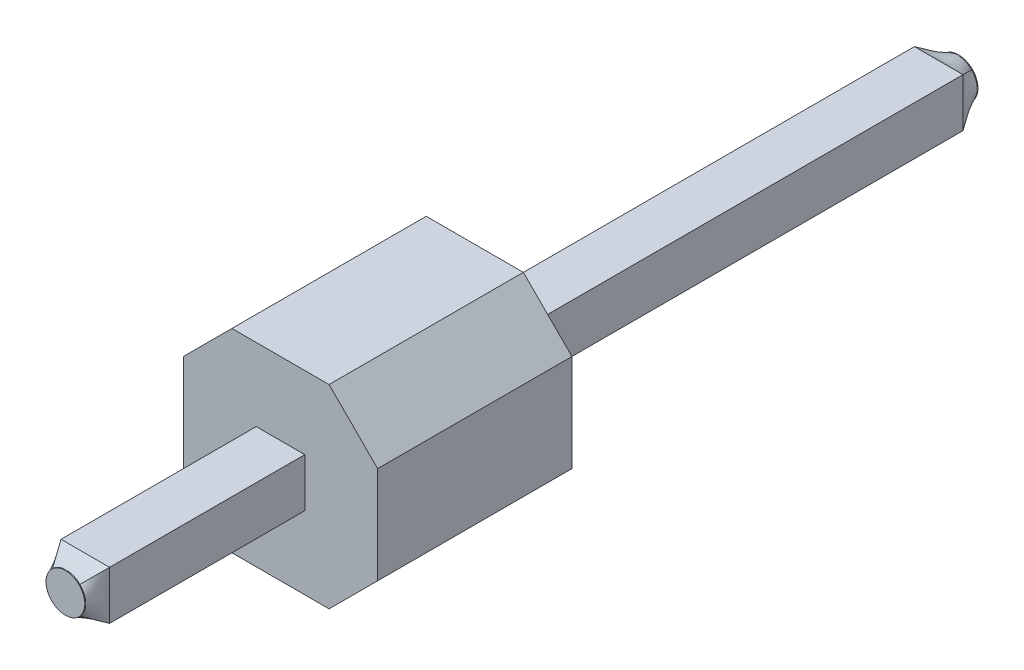
ISO-10303-21;
HEADER;
FILE_DESCRIPTION(('STEP AP214'),'2;1');
FILE_NAME('part.step','',(''),(''),'','','');
FILE_SCHEMA(('AUTOMOTIVE_DESIGN { 1 0 10303 214 1 1 1 1 }'));
ENDSEC;
DATA;
#1=APPLICATION_CONTEXT('core data for automotive mechanical design processes');
#2=APPLICATION_PROTOCOL_DEFINITION('international standard','automotive_design',2000,#1);
#3=PRODUCT_CONTEXT('',#1,'mechanical');
#4=PRODUCT('Part','Part','',(#3));
#5=PRODUCT_RELATED_PRODUCT_CATEGORY('part','',(#4));
#6=PRODUCT_DEFINITION_FORMATION('','',#4);
#7=PRODUCT_DEFINITION_CONTEXT('part definition',#1,'design');
#8=PRODUCT_DEFINITION('design','',#6,#7);
#9=PRODUCT_DEFINITION_SHAPE('','',#8);
#10=(LENGTH_UNIT() NAMED_UNIT(*) SI_UNIT(.MILLI.,.METRE.));
#11=(NAMED_UNIT(*) PLANE_ANGLE_UNIT() SI_UNIT($,.RADIAN.));
#12=(NAMED_UNIT(*) SI_UNIT($,.STERADIAN.) SOLID_ANGLE_UNIT());
#13=UNCERTAINTY_MEASURE_WITH_UNIT(LENGTH_MEASURE(1.E-05),#10,'distance_accuracy_value','');
#14=(GEOMETRIC_REPRESENTATION_CONTEXT(3) GLOBAL_UNCERTAINTY_ASSIGNED_CONTEXT((#13)) GLOBAL_UNIT_ASSIGNED_CONTEXT((#10,
#11,#12)) REPRESENTATION_CONTEXT('',''));
#15=CARTESIAN_POINT('',(0.,0.,0.));
#16=DIRECTION('',(0.,0.,1.));
#17=DIRECTION('',(1.,0.,0.));
#18=AXIS2_PLACEMENT_3D('',#15,#16,#17);
#19=CARTESIAN_POINT('',(0.3175,-0.317500000000001,-6.065));
#20=DIRECTION('',(1.,0.,0.));
#21=DIRECTION('',(0.,0.,-1.));
#22=AXIS2_PLACEMENT_3D('',#19,#20,#21);
#23=PLANE('',#22);
#24=DIRECTION('',(0.,-1.,0.));
#25=VECTOR('',#24,1.);
#26=CARTESIAN_POINT('',(0.3175,-0.317500000000001,2.54));
#27=LINE('',#26,#25);
#28=CARTESIAN_POINT('',(0.3175,0.317499999999999,2.54));
#29=VERTEX_POINT('',#28);
#30=CARTESIAN_POINT('',(0.3175,-0.317500000000001,2.54));
#31=VERTEX_POINT('',#30);
#32=EDGE_CURVE('E141',#29,#31,#27,.T.);
#33=ORIENTED_EDGE('',*,*,#32,.F.);
#34=DIRECTION('',(0.,0.,1.));
#35=VECTOR('',#34,1.);
#36=CARTESIAN_POINT('',(0.3175,0.317499999999999,-6.065));
#37=LINE('',#36,#35);
#38=CARTESIAN_POINT('',(0.3175,0.317499999999999,5.092));
#39=VERTEX_POINT('',#38);
#40=EDGE_CURVE('E123',#29,#39,#37,.T.);
#41=ORIENTED_EDGE('',*,*,#40,.T.);
#42=DIRECTION('',(0.,1.,0.));
#43=VECTOR('',#42,1.);
#44=CARTESIAN_POINT('',(0.3175,-0.317500000000001,5.092));
#45=LINE('',#44,#43);
#46=CARTESIAN_POINT('',(0.3175,-0.317500000000001,5.092));
#47=VERTEX_POINT('',#46);
#48=EDGE_CURVE('E149',#47,#39,#45,.T.);
#49=ORIENTED_EDGE('',*,*,#48,.F.);
#50=DIRECTION('',(0.,0.,1.));
#51=VECTOR('',#50,1.);
#52=CARTESIAN_POINT('',(0.3175,-0.317500000000001,-6.065));
#53=LINE('',#52,#51);
#54=EDGE_CURVE('E99',#31,#47,#53,.T.);
#55=ORIENTED_EDGE('',*,*,#54,.F.);
#56=EDGE_LOOP('',(#33,#41,#49,#55));
#57=FACE_BOUND('',#56,.T.);
#58=ADVANCED_FACE('F64',(#57),#23,.T.);
#59=CARTESIAN_POINT('',(-0.3175,-0.317500000000001,-6.065));
#60=DIRECTION('',(0.,-1.,0.));
#61=DIRECTION('',(0.,0.,-1.));
#62=AXIS2_PLACEMENT_3D('',#59,#60,#61);
#63=PLANE('',#62);
#64=DIRECTION('',(-1.,0.,0.));
#65=VECTOR('',#64,1.);
#66=CARTESIAN_POINT('',(-0.3175,-0.317500000000001,2.54));
#67=LINE('',#66,#65);
#68=CARTESIAN_POINT('',(-0.3175,-0.317500000000001,2.54));
#69=VERTEX_POINT('',#68);
#70=EDGE_CURVE('E83',#31,#69,#67,.T.);
#71=ORIENTED_EDGE('',*,*,#70,.F.);
#72=ORIENTED_EDGE('',*,*,#54,.T.);
#73=DIRECTION('',(1.,0.,0.));
#74=VECTOR('',#73,1.);
#75=CARTESIAN_POINT('',(-0.3175,-0.317500000000001,5.092));
#76=LINE('',#75,#74);
#77=CARTESIAN_POINT('',(-0.3175,-0.317500000000001,5.092));
#78=VERTEX_POINT('',#77);
#79=EDGE_CURVE('E154',#78,#47,#76,.T.);
#80=ORIENTED_EDGE('',*,*,#79,.F.);
#81=DIRECTION('',(0.,0.,1.));
#82=VECTOR('',#81,1.);
#83=CARTESIAN_POINT('',(-0.3175,-0.317500000000001,-6.065));
#84=LINE('',#83,#82);
#85=EDGE_CURVE('E168',#69,#78,#84,.T.);
#86=ORIENTED_EDGE('',*,*,#85,.F.);
#87=EDGE_LOOP('',(#71,#72,#80,#86));
#88=FACE_BOUND('',#87,.T.);
#89=ADVANCED_FACE('F444',(#88),#63,.T.);
#90=CARTESIAN_POINT('',(-0.3175,-0.317500000000001,-6.065));
#91=DIRECTION('',(-1.,0.,0.));
#92=DIRECTION('',(0.,0.,1.));
#93=AXIS2_PLACEMENT_3D('',#90,#91,#92);
#94=PLANE('',#93);
#95=DIRECTION('',(0.,1.,0.));
#96=VECTOR('',#95,1.);
#97=CARTESIAN_POINT('',(-0.3175,-0.317500000000001,2.54));
#98=LINE('',#97,#96);
#99=CARTESIAN_POINT('',(-0.3175,0.317499999999999,2.54));
#100=VERTEX_POINT('',#99);
#101=EDGE_CURVE('E130',#69,#100,#98,.T.);
#102=ORIENTED_EDGE('',*,*,#101,.F.);
#103=ORIENTED_EDGE('',*,*,#85,.T.);
#104=DIRECTION('',(0.,1.,0.));
#105=VECTOR('',#104,1.);
#106=CARTESIAN_POINT('',(-0.3175,-0.317500000000001,5.092));
#107=LINE('',#106,#105);
#108=CARTESIAN_POINT('',(-0.3175,0.317499999999999,5.092));
#109=VERTEX_POINT('',#108);
#110=EDGE_CURVE('E132',#109,#78,#107,.F.);
#111=ORIENTED_EDGE('',*,*,#110,.F.);
#112=DIRECTION('',(0.,0.,1.));
#113=VECTOR('',#112,1.);
#114=CARTESIAN_POINT('',(-0.3175,0.317499999999999,-6.065));
#115=LINE('',#114,#113);
#116=EDGE_CURVE('E120',#100,#109,#115,.T.);
#117=ORIENTED_EDGE('',*,*,#116,.F.);
#118=EDGE_LOOP('',(#102,#103,#111,#117));
#119=FACE_BOUND('',#118,.T.);
#120=ADVANCED_FACE('F129',(#119),#94,.T.);
#121=CARTESIAN_POINT('',(-0.3175,0.317499999999999,-6.065));
#122=DIRECTION('',(0.,1.,0.));
#123=DIRECTION('',(0.,0.,1.));
#124=AXIS2_PLACEMENT_3D('',#121,#122,#123);
#125=PLANE('',#124);
#126=DIRECTION('',(1.,0.,0.));
#127=VECTOR('',#126,1.);
#128=CARTESIAN_POINT('',(-0.3175,0.317499999999999,2.54));
#129=LINE('',#128,#127);
#130=EDGE_CURVE('E12',#100,#29,#129,.T.);
#131=ORIENTED_EDGE('',*,*,#130,.F.);
#132=ORIENTED_EDGE('',*,*,#116,.T.);
#133=DIRECTION('',(1.,0.,0.));
#134=VECTOR('',#133,1.);
#135=CARTESIAN_POINT('',(-0.3175,0.317499999999999,5.092));
#136=LINE('',#135,#134);
#137=EDGE_CURVE('E175',#39,#109,#136,.F.);
#138=ORIENTED_EDGE('',*,*,#137,.F.);
#139=ORIENTED_EDGE('',*,*,#40,.F.);
#140=EDGE_LOOP('',(#131,#132,#138,#139));
#141=FACE_BOUND('',#140,.T.);
#142=ADVANCED_FACE('F118',(#141),#125,.T.);
#143=CARTESIAN_POINT('',(-0.635,1.27,2.54));
#144=DIRECTION('',(0.,-1.,0.));
#145=DIRECTION('',(1.,0.,0.));
#146=AXIS2_PLACEMENT_3D('',#143,#144,#145);
#147=PLANE('',#146);
#148=DIRECTION('',(-1.,0.,0.));
#149=VECTOR('',#148,1.);
#150=CARTESIAN_POINT('',(-0.635,1.27,0.));
#151=LINE('',#150,#149);
#152=CARTESIAN_POINT('',(0.635,1.27,0.));
#153=VERTEX_POINT('',#152);
#154=CARTESIAN_POINT('',(-0.635,1.27,0.));
#155=VERTEX_POINT('',#154);
#156=EDGE_CURVE('E201',#153,#155,#151,.T.);
#157=ORIENTED_EDGE('',*,*,#156,.T.);
#158=DIRECTION('',(0.,0.,-1.));
#159=VECTOR('',#158,1.);
#160=CARTESIAN_POINT('',(-0.635,1.27,2.54));
#161=LINE('',#160,#159);
#162=CARTESIAN_POINT('',(-0.635,1.27,2.54));
#163=VERTEX_POINT('',#162);
#164=EDGE_CURVE('E540',#163,#155,#161,.T.);
#165=ORIENTED_EDGE('',*,*,#164,.F.);
#166=DIRECTION('',(-1.,0.,0.));
#167=VECTOR('',#166,1.);
#168=CARTESIAN_POINT('',(-0.635,1.27,2.54));
#169=LINE('',#168,#167);
#170=CARTESIAN_POINT('',(0.635,1.27,2.54));
#171=VERTEX_POINT('',#170);
#172=EDGE_CURVE('E569',#171,#163,#169,.T.);
#173=ORIENTED_EDGE('',*,*,#172,.F.);
#174=DIRECTION('',(0.,0.,-1.));
#175=VECTOR('',#174,1.);
#176=CARTESIAN_POINT('',(0.635,1.27,2.54));
#177=LINE('',#176,#175);
#178=EDGE_CURVE('E563',#171,#153,#177,.T.);
#179=ORIENTED_EDGE('',*,*,#178,.T.);
#180=EDGE_LOOP('',(#157,#165,#173,#179));
#181=FACE_BOUND('',#180,.T.);
#182=ADVANCED_FACE('F439',(#181),#147,.F.);
#183=CARTESIAN_POINT('',(-1.27,0.635,2.54));
#184=DIRECTION('',(0.707106781186547,-0.707106781186547,0.));
#185=DIRECTION('',(0.707106781186548,0.707106781186548,0.));
#186=AXIS2_PLACEMENT_3D('',#183,#184,#185);
#187=PLANE('',#186);
#188=DIRECTION('',(-0.707106781186547,-0.707106781186547,0.));
#189=VECTOR('',#188,1.);
#190=CARTESIAN_POINT('',(-1.27,0.635,0.));
#191=LINE('',#190,#189);
#192=CARTESIAN_POINT('',(-1.27,0.635,0.));
#193=VERTEX_POINT('',#192);
#194=EDGE_CURVE('E208',#155,#193,#191,.T.);
#195=ORIENTED_EDGE('',*,*,#194,.T.);
#196=DIRECTION('',(0.,0.,-1.));
#197=VECTOR('',#196,1.);
#198=CARTESIAN_POINT('',(-1.27,0.635,2.54));
#199=LINE('',#198,#197);
#200=CARTESIAN_POINT('',(-1.27,0.635,2.54));
#201=VERTEX_POINT('',#200);
#202=EDGE_CURVE('E545',#201,#193,#199,.T.);
#203=ORIENTED_EDGE('',*,*,#202,.F.);
#204=DIRECTION('',(-0.707106781186547,-0.707106781186547,0.));
#205=VECTOR('',#204,1.);
#206=CARTESIAN_POINT('',(-1.27,0.635,2.54));
#207=LINE('',#206,#205);
#208=EDGE_CURVE('E592',#163,#201,#207,.T.);
#209=ORIENTED_EDGE('',*,*,#208,.F.);
#210=ORIENTED_EDGE('',*,*,#164,.T.);
#211=EDGE_LOOP('',(#195,#203,#209,#210));
#212=FACE_BOUND('',#211,.T.);
#213=ADVANCED_FACE('F435',(#212),#187,.F.);
#214=CARTESIAN_POINT('',(-1.27,-0.635,2.54));
#215=DIRECTION('',(1.,0.,0.));
#216=DIRECTION('',(0.,0.,-1.));
#217=AXIS2_PLACEMENT_3D('',#214,#215,#216);
#218=PLANE('',#217);
#219=DIRECTION('',(0.,-1.,0.));
#220=VECTOR('',#219,1.);
#221=CARTESIAN_POINT('',(-1.27,-0.635,0.));
#222=LINE('',#221,#220);
#223=CARTESIAN_POINT('',(-1.27,-0.635,0.));
#224=VERTEX_POINT('',#223);
#225=EDGE_CURVE('E578',#193,#224,#222,.T.);
#226=ORIENTED_EDGE('',*,*,#225,.T.);
#227=DIRECTION('',(0.,0.,-1.));
#228=VECTOR('',#227,1.);
#229=CARTESIAN_POINT('',(-1.27,-0.635,2.54));
#230=LINE('',#229,#228);
#231=CARTESIAN_POINT('',(-1.27,-0.635,2.54));
#232=VERTEX_POINT('',#231);
#233=EDGE_CURVE('E548',#232,#224,#230,.T.);
#234=ORIENTED_EDGE('',*,*,#233,.F.);
#235=DIRECTION('',(0.,-1.,0.));
#236=VECTOR('',#235,1.);
#237=CARTESIAN_POINT('',(-1.27,-0.635,2.54));
#238=LINE('',#237,#236);
#239=EDGE_CURVE('E590',#201,#232,#238,.T.);
#240=ORIENTED_EDGE('',*,*,#239,.F.);
#241=ORIENTED_EDGE('',*,*,#202,.T.);
#242=EDGE_LOOP('',(#226,#234,#240,#241));
#243=FACE_BOUND('',#242,.T.);
#244=ADVANCED_FACE('F431',(#243),#218,.F.);
#245=CARTESIAN_POINT('',(-0.635,-1.27,2.54));
#246=DIRECTION('',(0.707106781186547,0.707106781186548,0.));
#247=DIRECTION('',(-0.707106781186548,0.707106781186547,0.));
#248=AXIS2_PLACEMENT_3D('',#245,#246,#247);
#249=PLANE('',#248);
#250=DIRECTION('',(0.707106781186548,-0.707106781186547,0.));
#251=VECTOR('',#250,1.);
#252=CARTESIAN_POINT('',(-0.635,-1.27,0.));
#253=LINE('',#252,#251);
#254=CARTESIAN_POINT('',(-0.635,-1.27,0.));
#255=VERTEX_POINT('',#254);
#256=EDGE_CURVE('E576',#224,#255,#253,.T.);
#257=ORIENTED_EDGE('',*,*,#256,.T.);
#258=DIRECTION('',(0.,0.,-1.));
#259=VECTOR('',#258,1.);
#260=CARTESIAN_POINT('',(-0.635,-1.27,2.54));
#261=LINE('',#260,#259);
#262=CARTESIAN_POINT('',(-0.635,-1.27,2.54));
#263=VERTEX_POINT('',#262);
#264=EDGE_CURVE('E551',#263,#255,#261,.T.);
#265=ORIENTED_EDGE('',*,*,#264,.F.);
#266=DIRECTION('',(0.707106781186548,-0.707106781186547,0.));
#267=VECTOR('',#266,1.);
#268=CARTESIAN_POINT('',(-0.635,-1.27,2.54));
#269=LINE('',#268,#267);
#270=EDGE_CURVE('E588',#232,#263,#269,.T.);
#271=ORIENTED_EDGE('',*,*,#270,.F.);
#272=ORIENTED_EDGE('',*,*,#233,.T.);
#273=EDGE_LOOP('',(#257,#265,#271,#272));
#274=FACE_BOUND('',#273,.T.);
#275=ADVANCED_FACE('F427',(#274),#249,.F.);
#276=CARTESIAN_POINT('',(-0.635,-1.27,2.54));
#277=DIRECTION('',(0.,1.,0.));
#278=DIRECTION('',(0.,0.,1.));
#279=AXIS2_PLACEMENT_3D('',#276,#277,#278);
#280=PLANE('',#279);
#281=DIRECTION('',(1.,0.,0.));
#282=VECTOR('',#281,1.);
#283=CARTESIAN_POINT('',(-0.635,-1.27,0.));
#284=LINE('',#283,#282);
#285=CARTESIAN_POINT('',(0.635,-1.27,0.));
#286=VERTEX_POINT('',#285);
#287=EDGE_CURVE('E574',#255,#286,#284,.T.);
#288=ORIENTED_EDGE('',*,*,#287,.T.);
#289=DIRECTION('',(0.,0.,-1.));
#290=VECTOR('',#289,1.);
#291=CARTESIAN_POINT('',(0.635,-1.27,2.54));
#292=LINE('',#291,#290);
#293=CARTESIAN_POINT('',(0.635,-1.27,2.54));
#294=VERTEX_POINT('',#293);
#295=EDGE_CURVE('E554',#294,#286,#292,.T.);
#296=ORIENTED_EDGE('',*,*,#295,.F.);
#297=DIRECTION('',(1.,0.,0.));
#298=VECTOR('',#297,1.);
#299=CARTESIAN_POINT('',(-0.635,-1.27,2.54));
#300=LINE('',#299,#298);
#301=EDGE_CURVE('E586',#263,#294,#300,.T.);
#302=ORIENTED_EDGE('',*,*,#301,.F.);
#303=ORIENTED_EDGE('',*,*,#264,.T.);
#304=EDGE_LOOP('',(#288,#296,#302,#303));
#305=FACE_BOUND('',#304,.T.);
#306=ADVANCED_FACE('F423',(#305),#280,.F.);
#307=CARTESIAN_POINT('',(0.635,-1.27,2.54));
#308=DIRECTION('',(-0.707106781186547,0.707106781186547,0.));
#309=DIRECTION('',(-0.707106781186548,-0.707106781186548,0.));
#310=AXIS2_PLACEMENT_3D('',#307,#308,#309);
#311=PLANE('',#310);
#312=DIRECTION('',(0.707106781186547,0.707106781186547,0.));
#313=VECTOR('',#312,1.);
#314=CARTESIAN_POINT('',(0.635,-1.27,0.));
#315=LINE('',#314,#313);
#316=CARTESIAN_POINT('',(1.27,-0.635,0.));
#317=VERTEX_POINT('',#316);
#318=EDGE_CURVE('E572',#286,#317,#315,.T.);
#319=ORIENTED_EDGE('',*,*,#318,.T.);
#320=DIRECTION('',(0.,0.,-1.));
#321=VECTOR('',#320,1.);
#322=CARTESIAN_POINT('',(1.27,-0.635,2.54));
#323=LINE('',#322,#321);
#324=CARTESIAN_POINT('',(1.27,-0.635,2.54));
#325=VERTEX_POINT('',#324);
#326=EDGE_CURVE('E557',#325,#317,#323,.T.);
#327=ORIENTED_EDGE('',*,*,#326,.F.);
#328=DIRECTION('',(0.707106781186547,0.707106781186547,0.));
#329=VECTOR('',#328,1.);
#330=CARTESIAN_POINT('',(0.635,-1.27,2.54));
#331=LINE('',#330,#329);
#332=EDGE_CURVE('E584',#294,#325,#331,.T.);
#333=ORIENTED_EDGE('',*,*,#332,.F.);
#334=ORIENTED_EDGE('',*,*,#295,.T.);
#335=EDGE_LOOP('',(#319,#327,#333,#334));
#336=FACE_BOUND('',#335,.T.);
#337=ADVANCED_FACE('F419',(#336),#311,.F.);
#338=CARTESIAN_POINT('',(1.27,-0.635,2.54));
#339=DIRECTION('',(-1.,0.,0.));
#340=DIRECTION('',(0.,0.,1.));
#341=AXIS2_PLACEMENT_3D('',#338,#339,#340);
#342=PLANE('',#341);
#343=DIRECTION('',(0.,1.,0.));
#344=VECTOR('',#343,1.);
#345=CARTESIAN_POINT('',(1.27,-0.635,0.));
#346=LINE('',#345,#344);
#347=CARTESIAN_POINT('',(1.27,0.635,0.));
#348=VERTEX_POINT('',#347);
#349=EDGE_CURVE('E570',#317,#348,#346,.T.);
#350=ORIENTED_EDGE('',*,*,#349,.T.);
#351=DIRECTION('',(0.,0.,-1.));
#352=VECTOR('',#351,1.);
#353=CARTESIAN_POINT('',(1.27,0.635,2.54));
#354=LINE('',#353,#352);
#355=CARTESIAN_POINT('',(1.27,0.635,2.54));
#356=VERTEX_POINT('',#355);
#357=EDGE_CURVE('E560',#356,#348,#354,.T.);
#358=ORIENTED_EDGE('',*,*,#357,.F.);
#359=DIRECTION('',(0.,1.,0.));
#360=VECTOR('',#359,1.);
#361=CARTESIAN_POINT('',(1.27,-0.635,2.54));
#362=LINE('',#361,#360);
#363=EDGE_CURVE('E582',#325,#356,#362,.T.);
#364=ORIENTED_EDGE('',*,*,#363,.F.);
#365=ORIENTED_EDGE('',*,*,#326,.T.);
#366=EDGE_LOOP('',(#350,#358,#364,#365));
#367=FACE_BOUND('',#366,.T.);
#368=ADVANCED_FACE('F415',(#367),#342,.F.);
#369=CARTESIAN_POINT('',(1.27,0.635,2.54));
#370=DIRECTION('',(-0.707106781186548,-0.707106781186547,0.));
#371=DIRECTION('',(0.707106781186547,-0.707106781186548,0.));
#372=AXIS2_PLACEMENT_3D('',#369,#370,#371);
#373=PLANE('',#372);
#374=DIRECTION('',(-0.707106781186547,0.707106781186548,0.));
#375=VECTOR('',#374,1.);
#376=CARTESIAN_POINT('',(1.27,0.635,0.));
#377=LINE('',#376,#375);
#378=EDGE_CURVE('E567',#348,#153,#377,.T.);
#379=ORIENTED_EDGE('',*,*,#378,.T.);
#380=ORIENTED_EDGE('',*,*,#178,.F.);
#381=DIRECTION('',(-0.707106781186547,0.707106781186548,0.));
#382=VECTOR('',#381,1.);
#383=CARTESIAN_POINT('',(1.27,0.635,2.54));
#384=LINE('',#383,#382);
#385=EDGE_CURVE('E566',#356,#171,#384,.T.);
#386=ORIENTED_EDGE('',*,*,#385,.F.);
#387=ORIENTED_EDGE('',*,*,#357,.T.);
#388=EDGE_LOOP('',(#379,#380,#386,#387));
#389=FACE_BOUND('',#388,.T.);
#390=ADVANCED_FACE('F408',(#389),#373,.F.);
#391=CARTESIAN_POINT('',(1.27,1.27,2.54));
#392=DIRECTION('',(0.,0.,1.));
#393=DIRECTION('',(1.,0.,0.));
#394=AXIS2_PLACEMENT_3D('',#391,#392,#393);
#395=PLANE('',#394);
#396=ORIENTED_EDGE('',*,*,#130,.T.);
#397=ORIENTED_EDGE('',*,*,#32,.T.);
#398=ORIENTED_EDGE('',*,*,#70,.T.);
#399=ORIENTED_EDGE('',*,*,#101,.T.);
#400=EDGE_LOOP('',(#396,#397,#398,#399));
#401=FACE_BOUND('',#400,.T.);
#402=ORIENTED_EDGE('',*,*,#172,.T.);
#403=ORIENTED_EDGE('',*,*,#208,.T.);
#404=ORIENTED_EDGE('',*,*,#239,.T.);
#405=ORIENTED_EDGE('',*,*,#270,.T.);
#406=ORIENTED_EDGE('',*,*,#301,.T.);
#407=ORIENTED_EDGE('',*,*,#332,.T.);
#408=ORIENTED_EDGE('',*,*,#363,.T.);
#409=ORIENTED_EDGE('',*,*,#385,.T.);
#410=EDGE_LOOP('',(#402,#403,#404,#405,#406,#407,#408,#409));
#411=FACE_BOUND('',#410,.T.);
#412=ADVANCED_FACE('F137',(#401,#411),#395,.T.);
#413=CARTESIAN_POINT('',(1.27,1.27,0.));
#414=DIRECTION('',(0.,0.,1.));
#415=DIRECTION('',(1.,0.,0.));
#416=AXIS2_PLACEMENT_3D('',#413,#414,#415);
#417=PLANE('',#416);
#418=DIRECTION('',(0.,-1.,0.));
#419=VECTOR('',#418,1.);
#420=CARTESIAN_POINT('',(0.3175,-0.317500000000001,0.));
#421=LINE('',#420,#419);
#422=CARTESIAN_POINT('',(0.3175,0.317499999999999,0.));
#423=VERTEX_POINT('',#422);
#424=CARTESIAN_POINT('',(0.3175,-0.317500000000001,0.));
#425=VERTEX_POINT('',#424);
#426=EDGE_CURVE('E139',#423,#425,#421,.T.);
#427=ORIENTED_EDGE('',*,*,#426,.F.);
#428=DIRECTION('',(1.,0.,0.));
#429=VECTOR('',#428,1.);
#430=CARTESIAN_POINT('',(-0.3175,0.317499999999999,0.));
#431=LINE('',#430,#429);
#432=CARTESIAN_POINT('',(-0.3175,0.317499999999999,0.));
#433=VERTEX_POINT('',#432);
#434=EDGE_CURVE('E74',#433,#423,#431,.T.);
#435=ORIENTED_EDGE('',*,*,#434,.F.);
#436=DIRECTION('',(0.,1.,0.));
#437=VECTOR('',#436,1.);
#438=CARTESIAN_POINT('',(-0.3175,-0.317500000000001,0.));
#439=LINE('',#438,#437);
#440=CARTESIAN_POINT('',(-0.3175,-0.317500000000001,0.));
#441=VERTEX_POINT('',#440);
#442=EDGE_CURVE('E538',#441,#433,#439,.T.);
#443=ORIENTED_EDGE('',*,*,#442,.F.);
#444=DIRECTION('',(-1.,0.,0.));
#445=VECTOR('',#444,1.);
#446=CARTESIAN_POINT('',(-0.3175,-0.317500000000001,0.));
#447=LINE('',#446,#445);
#448=EDGE_CURVE('E144',#425,#441,#447,.T.);
#449=ORIENTED_EDGE('',*,*,#448,.F.);
#450=EDGE_LOOP('',(#427,#435,#443,#449));
#451=FACE_BOUND('',#450,.T.);
#452=ORIENTED_EDGE('',*,*,#156,.F.);
#453=ORIENTED_EDGE('',*,*,#378,.F.);
#454=ORIENTED_EDGE('',*,*,#349,.F.);
#455=ORIENTED_EDGE('',*,*,#318,.F.);
#456=ORIENTED_EDGE('',*,*,#287,.F.);
#457=ORIENTED_EDGE('',*,*,#256,.F.);
#458=ORIENTED_EDGE('',*,*,#225,.F.);
#459=ORIENTED_EDGE('',*,*,#194,.F.);
#460=EDGE_LOOP('',(#452,#453,#454,#455,#456,#457,#458,#459));
#461=FACE_BOUND('',#460,.T.);
#462=ADVANCED_FACE('F407',(#451,#461),#417,.F.);
#463=CARTESIAN_POINT('',(-0.3175,0.317499999999999,-6.065));
#464=VERTEX_POINT('',#463);
#465=EDGE_CURVE('E134',#464,#433,#115,.T.);
#466=ORIENTED_EDGE('',*,*,#465,.T.);
#467=ORIENTED_EDGE('',*,*,#434,.T.);
#468=CARTESIAN_POINT('',(0.3175,0.317499999999999,-6.065));
#469=VERTEX_POINT('',#468);
#470=EDGE_CURVE('E135',#469,#423,#37,.T.);
#471=ORIENTED_EDGE('',*,*,#470,.F.);
#472=DIRECTION('',(-1.,0.,0.));
#473=VECTOR('',#472,1.);
#474=CARTESIAN_POINT('',(-0.3175,0.317499999999999,-6.065));
#475=LINE('',#474,#473);
#476=EDGE_CURVE('E153',#469,#464,#475,.T.);
#477=ORIENTED_EDGE('',*,*,#476,.T.);
#478=EDGE_LOOP('',(#466,#467,#471,#477));
#479=FACE_BOUND('',#478,.T.);
#480=ADVANCED_FACE('F411',(#479),#125,.T.);
#481=CARTESIAN_POINT('',(-0.3175,-0.317500000000001,-6.065));
#482=VERTEX_POINT('',#481);
#483=EDGE_CURVE('E166',#482,#441,#84,.T.);
#484=ORIENTED_EDGE('',*,*,#483,.T.);
#485=ORIENTED_EDGE('',*,*,#442,.T.);
#486=ORIENTED_EDGE('',*,*,#465,.F.);
#487=DIRECTION('',(0.,-1.,0.));
#488=VECTOR('',#487,1.);
#489=CARTESIAN_POINT('',(-0.3175,-0.317500000000001,-6.065));
#490=LINE('',#489,#488);
#491=EDGE_CURVE('E157',#464,#482,#490,.T.);
#492=ORIENTED_EDGE('',*,*,#491,.T.);
#493=EDGE_LOOP('',(#484,#485,#486,#492));
#494=FACE_BOUND('',#493,.T.);
#495=ADVANCED_FACE('F449',(#494),#94,.T.);
#496=CARTESIAN_POINT('',(0.3175,-0.317500000000001,-6.065));
#497=VERTEX_POINT('',#496);
#498=EDGE_CURVE('E163',#497,#425,#53,.T.);
#499=ORIENTED_EDGE('',*,*,#498,.T.);
#500=ORIENTED_EDGE('',*,*,#448,.T.);
#501=ORIENTED_EDGE('',*,*,#483,.F.);
#502=DIRECTION('',(1.,0.,0.));
#503=VECTOR('',#502,1.);
#504=CARTESIAN_POINT('',(-0.3175,-0.317500000000001,-6.065));
#505=LINE('',#504,#503);
#506=EDGE_CURVE('E160',#482,#497,#505,.T.);
#507=ORIENTED_EDGE('',*,*,#506,.T.);
#508=EDGE_LOOP('',(#499,#500,#501,#507));
#509=FACE_BOUND('',#508,.T.);
#510=ADVANCED_FACE('F447',(#509),#63,.T.);
#511=ORIENTED_EDGE('',*,*,#470,.T.);
#512=ORIENTED_EDGE('',*,*,#426,.T.);
#513=ORIENTED_EDGE('',*,*,#498,.F.);
#514=DIRECTION('',(0.,1.,0.));
#515=VECTOR('',#514,1.);
#516=CARTESIAN_POINT('',(0.3175,-0.317500000000001,-6.065));
#517=LINE('',#516,#515);
#518=EDGE_CURVE('E150',#497,#469,#517,.T.);
#519=ORIENTED_EDGE('',*,*,#518,.T.);
#520=EDGE_LOOP('',(#511,#512,#513,#519));
#521=FACE_BOUND('',#520,.T.);
#522=ADVANCED_FACE('F348',(#521),#23,.T.);
#523=CARTESIAN_POINT('',(-0.179605122421383,0.179605122421383,5.342));
#524=CARTESIAN_POINT('',(-0.3175,0.317499999999999,5.092));
#525=CARTESIAN_POINT('',(-0.13727178908805,0.221938455754716,5.342));
#526=CARTESIAN_POINT('',(-0.211666666666667,0.317499999999999,5.092));
#527=CARTESIAN_POINT('',(-0.0701401632285107,0.254,5.342));
#528=CARTESIAN_POINT('',(-0.105833333333333,0.317499999999999,5.092));
#529=CARTESIAN_POINT('',(0.0701401632285107,0.254,5.342));
#530=CARTESIAN_POINT('',(0.105833333333333,0.317499999999999,5.092));
#531=CARTESIAN_POINT('',(0.13727178908805,0.221938455754716,5.342));
#532=CARTESIAN_POINT('',(0.211666666666667,0.317499999999999,5.092));
#533=CARTESIAN_POINT('',(0.179605122421383,0.179605122421383,5.342));
#534=CARTESIAN_POINT('',(0.3175,0.317499999999999,5.092));
#535=B_SPLINE_SURFACE_WITH_KNOTS('',3,1,((#523,#524),(#525,#526),(#527,#528),(#529,#530),(#531,
#532),(#533,#534)),.UNSPECIFIED.,.F.,.F.,.F.,(4,2,4),(2,2),(0.,0.5,1.),(0.,1.),.UNSPECIFIED.);
#536=CARTESIAN_POINT('',(0.,0.,5.342));
#537=DIRECTION('',(0.,0.,1.));
#538=DIRECTION('',(1.,0.,0.));
#539=AXIS2_PLACEMENT_3D('',#536,#537,#538);
#540=CIRCLE('',#539,0.254);
#541=CARTESIAN_POINT('',(0.179605122421383,0.179605122421383,5.342));
#542=VERTEX_POINT('',#541);
#543=CARTESIAN_POINT('',(-0.179605122421383,0.179605122421383,5.342));
#544=VERTEX_POINT('',#543);
#545=EDGE_CURVE('E182',#542,#544,#540,.T.);
#546=DIRECTION('',(0.43491091182431,0.434910911824308,-0.788482718613602));
#547=VECTOR('',#546,1.);
#548=CARTESIAN_POINT('',(0.248552561210691,0.248552561210691,5.217));
#549=LINE('',#548,#547);
#550=EDGE_CURVE('E186',#542,#39,#549,.T.);
#551=DIRECTION('',(0.43491091182431,-0.434910911824308,0.788482718613602));
#552=VECTOR('',#551,1.);
#553=CARTESIAN_POINT('',(-0.248552561210691,0.248552561210691,5.217));
#554=LINE('',#553,#552);
#555=EDGE_CURVE('E362',#109,#544,#554,.T.);
#556=ORIENTED_EDGE('',*,*,#545,.F.);
#557=ORIENTED_EDGE('',*,*,#550,.T.);
#558=ORIENTED_EDGE('',*,*,#137,.T.);
#559=ORIENTED_EDGE('',*,*,#555,.T.);
#560=EDGE_LOOP('',(#556,#557,#558,#559));
#561=FACE_BOUND('',#560,.T.);
#562=ADVANCED_FACE('F336',(#561),#535,.T.);
#563=CARTESIAN_POINT('',(0.179605122421383,0.179605122421383,5.342));
#564=CARTESIAN_POINT('',(0.3175,0.317499999999999,5.092));
#565=CARTESIAN_POINT('',(0.221938455754716,0.13727178908805,5.342));
#566=CARTESIAN_POINT('',(0.3175,0.211666666666666,5.092));
#567=CARTESIAN_POINT('',(0.254,0.0701401632285107,5.342));
#568=CARTESIAN_POINT('',(0.3175,0.105833333333332,5.092));
#569=CARTESIAN_POINT('',(0.254,-0.0701401632285108,5.342));
#570=CARTESIAN_POINT('',(0.3175,-0.105833333333334,5.092));
#571=CARTESIAN_POINT('',(0.221938455754716,-0.13727178908805,5.342));
#572=CARTESIAN_POINT('',(0.3175,-0.211666666666668,5.092));
#573=CARTESIAN_POINT('',(0.179605122421383,-0.179605122421383,5.342));
#574=CARTESIAN_POINT('',(0.3175,-0.317500000000001,5.092));
#575=B_SPLINE_SURFACE_WITH_KNOTS('',3,1,((#563,#564),(#565,#566),(#567,#568),(#569,#570),(#571,
#572),(#573,#574)),.UNSPECIFIED.,.F.,.F.,.F.,(4,2,4),(2,2),(0.,0.5,1.),(0.,1.),.UNSPECIFIED.);
#576=CARTESIAN_POINT('',(0.179605122421383,-0.179605122421383,5.342));
#577=VERTEX_POINT('',#576);
#578=EDGE_CURVE('E185',#577,#542,#540,.T.);
#579=DIRECTION('',(0.434910911824309,-0.434910911824312,-0.7884827186136));
#580=VECTOR('',#579,1.);
#581=CARTESIAN_POINT('',(0.248552561210691,-0.248552561210692,5.217));
#582=LINE('',#581,#580);
#583=EDGE_CURVE('E370',#577,#47,#582,.T.);
#584=ORIENTED_EDGE('',*,*,#578,.F.);
#585=ORIENTED_EDGE('',*,*,#583,.T.);
#586=ORIENTED_EDGE('',*,*,#48,.T.);
#587=ORIENTED_EDGE('',*,*,#550,.F.);
#588=EDGE_LOOP('',(#584,#585,#586,#587));
#589=FACE_BOUND('',#588,.T.);
#590=ADVANCED_FACE('F347',(#589),#575,.T.);
#591=CARTESIAN_POINT('',(-0.179605122421383,-0.179605122421383,5.342));
#592=CARTESIAN_POINT('',(-0.3175,-0.317500000000001,5.092));
#593=CARTESIAN_POINT('',(-0.221938455754716,-0.13727178908805,5.342));
#594=CARTESIAN_POINT('',(-0.3175,-0.211666666666667,5.092));
#595=CARTESIAN_POINT('',(-0.254,-0.0701401632285107,5.342));
#596=CARTESIAN_POINT('',(-0.3175,-0.105833333333334,5.092));
#597=CARTESIAN_POINT('',(-0.254,0.0701401632285108,5.342));
#598=CARTESIAN_POINT('',(-0.3175,0.105833333333333,5.092));
#599=CARTESIAN_POINT('',(-0.221938455754716,0.13727178908805,5.342));
#600=CARTESIAN_POINT('',(-0.3175,0.211666666666666,5.092));
#601=CARTESIAN_POINT('',(-0.179605122421383,0.179605122421383,5.342));
#602=CARTESIAN_POINT('',(-0.3175,0.317499999999999,5.092));
#603=B_SPLINE_SURFACE_WITH_KNOTS('',3,1,((#591,#592),(#593,#594),(#595,#596),(#597,#598),(#599,
#600),(#601,#602)),.UNSPECIFIED.,.F.,.F.,.F.,(4,2,4),(2,2),(0.,0.5,1.),(0.,1.),.UNSPECIFIED.);
#604=CARTESIAN_POINT('',(-0.179605122421383,-0.179605122421383,5.342));
#605=VERTEX_POINT('',#604);
#606=EDGE_CURVE('E199',#544,#605,#540,.T.);
#607=DIRECTION('',(-0.434910911824309,-0.434910911824312,-0.7884827186136));
#608=VECTOR('',#607,1.);
#609=CARTESIAN_POINT('',(-0.248552561210692,-0.248552561210692,5.217));
#610=LINE('',#609,#608);
#611=EDGE_CURVE('E617',#605,#78,#610,.T.);
#612=ORIENTED_EDGE('',*,*,#606,.F.);
#613=ORIENTED_EDGE('',*,*,#555,.F.);
#614=ORIENTED_EDGE('',*,*,#110,.T.);
#615=ORIENTED_EDGE('',*,*,#611,.F.);
#616=EDGE_LOOP('',(#612,#613,#614,#615));
#617=FACE_BOUND('',#616,.T.);
#618=ADVANCED_FACE('F396',(#617),#603,.T.);
#619=CARTESIAN_POINT('',(0.179605122421383,-0.179605122421383,5.342));
#620=CARTESIAN_POINT('',(0.3175,-0.317500000000001,5.092));
#621=CARTESIAN_POINT('',(0.13727178908805,-0.221938455754716,5.342));
#622=CARTESIAN_POINT('',(0.211666666666667,-0.317500000000001,5.092));
#623=CARTESIAN_POINT('',(0.0701401632285107,-0.254,5.342));
#624=CARTESIAN_POINT('',(0.105833333333333,-0.317500000000001,5.092));
#625=CARTESIAN_POINT('',(-0.0701401632285108,-0.254,5.342));
#626=CARTESIAN_POINT('',(-0.105833333333333,-0.317500000000001,5.092));
#627=CARTESIAN_POINT('',(-0.13727178908805,-0.221938455754716,5.342));
#628=CARTESIAN_POINT('',(-0.211666666666667,-0.317500000000001,5.092));
#629=CARTESIAN_POINT('',(-0.179605122421383,-0.179605122421383,5.342));
#630=CARTESIAN_POINT('',(-0.3175,-0.317500000000001,5.092));
#631=B_SPLINE_SURFACE_WITH_KNOTS('',3,1,((#619,#620),(#621,#622),(#623,#624),(#625,#626),(#627,
#628),(#629,#630)),.UNSPECIFIED.,.F.,.F.,.F.,(4,2,4),(2,2),(0.,0.5,1.),(0.,1.),.UNSPECIFIED.);
#632=EDGE_CURVE('E67',#605,#577,#540,.T.);
#633=ORIENTED_EDGE('',*,*,#632,.F.);
#634=ORIENTED_EDGE('',*,*,#611,.T.);
#635=ORIENTED_EDGE('',*,*,#79,.T.);
#636=ORIENTED_EDGE('',*,*,#583,.F.);
#637=EDGE_LOOP('',(#633,#634,#635,#636));
#638=FACE_BOUND('',#637,.T.);
#639=ADVANCED_FACE('F256',(#638),#631,.T.);
#640=CARTESIAN_POINT('',(-0.179605122421383,0.179605122421383,-6.315));
#641=CARTESIAN_POINT('',(-0.3175,0.317499999999999,-6.065));
#642=CARTESIAN_POINT('',(-0.221938455754716,0.13727178908805,-6.315));
#643=CARTESIAN_POINT('',(-0.3175,0.211666666666666,-6.065));
#644=CARTESIAN_POINT('',(-0.254,0.0701401632285107,-6.315));
#645=CARTESIAN_POINT('',(-0.3175,0.105833333333332,-6.065));
#646=CARTESIAN_POINT('',(-0.254,-0.0701401632285108,-6.315));
#647=CARTESIAN_POINT('',(-0.3175,-0.105833333333334,-6.065));
#648=CARTESIAN_POINT('',(-0.221938455754716,-0.13727178908805,-6.315));
#649=CARTESIAN_POINT('',(-0.3175,-0.211666666666668,-6.065));
#650=CARTESIAN_POINT('',(-0.179605122421383,-0.179605122421383,-6.315));
#651=CARTESIAN_POINT('',(-0.3175,-0.317500000000001,-6.065));
#652=B_SPLINE_SURFACE_WITH_KNOTS('',3,1,((#640,#641),(#642,#643),(#644,#645),(#646,#647),(#648,
#649),(#650,#651)),.UNSPECIFIED.,.F.,.F.,.F.,(4,2,4),(2,2),(0.,0.5,1.),(0.,1.),.UNSPECIFIED.);
#653=CARTESIAN_POINT('',(-0.179605122421383,0.179605122421383,-6.315));
#654=CARTESIAN_POINT('',(-0.221938455754716,0.13727178908805,-6.315));
#655=CARTESIAN_POINT('',(-0.254,0.0701401632285107,-6.315));
#656=CARTESIAN_POINT('',(-0.254,-0.0701401632285108,-6.315));
#657=CARTESIAN_POINT('',(-0.221938455754716,-0.13727178908805,-6.315));
#658=CARTESIAN_POINT('',(-0.179605122421383,-0.179605122421383,-6.315));
#659=B_SPLINE_CURVE_WITH_KNOTS('',3,(#653,#654,#655,#656,#657,#658),.UNSPECIFIED.,.F.,.F.,(4,2,
4),(0.,0.5,1.),.UNSPECIFIED.);
#660=CARTESIAN_POINT('',(-0.179605122421383,0.179605122421383,-6.315));
#661=VERTEX_POINT('',#660);
#662=CARTESIAN_POINT('',(-0.179605122421383,-0.179605122421383,-6.315));
#663=VERTEX_POINT('',#662);
#664=EDGE_CURVE('E284',#661,#663,#659,.T.);
#665=DIRECTION('',(-0.434910911824309,-0.434910911824312,0.7884827186136));
#666=VECTOR('',#665,1.);
#667=CARTESIAN_POINT('',(-0.248552561210691,-0.248552561210692,-6.19));
#668=LINE('',#667,#666);
#669=EDGE_CURVE('E278',#663,#482,#668,.T.);
#670=DIRECTION('',(0.43491091182431,-0.434910911824308,-0.788482718613602));
#671=VECTOR('',#670,1.);
#672=CARTESIAN_POINT('',(-0.248552561210691,0.248552561210691,-6.19));
#673=LINE('',#672,#671);
#674=EDGE_CURVE('E270',#464,#661,#673,.T.);
#675=ORIENTED_EDGE('',*,*,#664,.T.);
#676=ORIENTED_EDGE('',*,*,#669,.T.);
#677=ORIENTED_EDGE('',*,*,#491,.F.);
#678=ORIENTED_EDGE('',*,*,#674,.T.);
#679=EDGE_LOOP('',(#675,#676,#677,#678));
#680=FACE_BOUND('',#679,.T.);
#681=ADVANCED_FACE('F249',(#680),#652,.T.);
#682=CARTESIAN_POINT('',(-0.179605122421383,-0.179605122421383,-6.315));
#683=CARTESIAN_POINT('',(-0.3175,-0.317500000000001,-6.065));
#684=CARTESIAN_POINT('',(-0.13727178908805,-0.221938455754716,-6.315));
#685=CARTESIAN_POINT('',(-0.211666666666667,-0.317500000000001,-6.065));
#686=CARTESIAN_POINT('',(-0.0701401632285107,-0.254,-6.315));
#687=CARTESIAN_POINT('',(-0.105833333333334,-0.317500000000001,-6.065));
#688=CARTESIAN_POINT('',(0.0701401632285108,-0.254,-6.315));
#689=CARTESIAN_POINT('',(0.105833333333333,-0.317500000000001,-6.065));
#690=CARTESIAN_POINT('',(0.13727178908805,-0.221938455754716,-6.315));
#691=CARTESIAN_POINT('',(0.211666666666666,-0.317500000000001,-6.065));
#692=CARTESIAN_POINT('',(0.179605122421383,-0.179605122421383,-6.315));
#693=CARTESIAN_POINT('',(0.3175,-0.317500000000001,-6.065));
#694=B_SPLINE_SURFACE_WITH_KNOTS('',3,1,((#682,#683),(#684,#685),(#686,#687),(#688,#689),(#690,
#691),(#692,#693)),.UNSPECIFIED.,.F.,.F.,.F.,(4,2,4),(2,2),(0.,0.5,1.),(0.,1.),.UNSPECIFIED.);
#695=CARTESIAN_POINT('',(-0.179605122421383,-0.179605122421383,-6.315));
#696=CARTESIAN_POINT('',(-0.13727178908805,-0.221938455754716,-6.315));
#697=CARTESIAN_POINT('',(-0.0701401632285107,-0.254,-6.315));
#698=CARTESIAN_POINT('',(0.0701401632285108,-0.254,-6.315));
#699=CARTESIAN_POINT('',(0.13727178908805,-0.221938455754716,-6.315));
#700=CARTESIAN_POINT('',(0.179605122421383,-0.179605122421383,-6.315));
#701=B_SPLINE_CURVE_WITH_KNOTS('',3,(#695,#696,#697,#698,#699,#700),.UNSPECIFIED.,.F.,.F.,(4,2,
4),(0.,0.5,1.),.UNSPECIFIED.);
#702=CARTESIAN_POINT('',(0.179605122421383,-0.179605122421383,-6.315));
#703=VERTEX_POINT('',#702);
#704=EDGE_CURVE('E279',#663,#703,#701,.T.);
#705=DIRECTION('',(0.434910911824309,-0.434910911824312,0.7884827186136));
#706=VECTOR('',#705,1.);
#707=CARTESIAN_POINT('',(0.248552561210692,-0.248552561210692,-6.19));
#708=LINE('',#707,#706);
#709=EDGE_CURVE('E108',#703,#497,#708,.T.);
#710=ORIENTED_EDGE('',*,*,#704,.T.);
#711=ORIENTED_EDGE('',*,*,#709,.T.);
#712=ORIENTED_EDGE('',*,*,#506,.F.);
#713=ORIENTED_EDGE('',*,*,#669,.F.);
#714=EDGE_LOOP('',(#710,#711,#712,#713));
#715=FACE_BOUND('',#714,.T.);
#716=ADVANCED_FACE('F255',(#715),#694,.T.);
#717=CARTESIAN_POINT('',(0.179605122421383,0.179605122421383,-6.315));
#718=CARTESIAN_POINT('',(0.3175,0.317499999999999,-6.065));
#719=CARTESIAN_POINT('',(0.13727178908805,0.221938455754716,-6.315));
#720=CARTESIAN_POINT('',(0.211666666666667,0.317499999999999,-6.065));
#721=CARTESIAN_POINT('',(0.0701401632285107,0.254,-6.315));
#722=CARTESIAN_POINT('',(0.105833333333333,0.317499999999999,-6.065));
#723=CARTESIAN_POINT('',(-0.0701401632285107,0.254,-6.315));
#724=CARTESIAN_POINT('',(-0.105833333333333,0.317499999999999,-6.065));
#725=CARTESIAN_POINT('',(-0.13727178908805,0.221938455754716,-6.315));
#726=CARTESIAN_POINT('',(-0.211666666666667,0.317499999999999,-6.065));
#727=CARTESIAN_POINT('',(-0.179605122421383,0.179605122421383,-6.315));
#728=CARTESIAN_POINT('',(-0.3175,0.317499999999999,-6.065));
#729=B_SPLINE_SURFACE_WITH_KNOTS('',3,1,((#717,#718),(#719,#720),(#721,#722),(#723,#724),(#725,
#726),(#727,#728)),.UNSPECIFIED.,.F.,.F.,.F.,(4,2,4),(2,2),(0.,0.5,1.),(0.,1.),.UNSPECIFIED.);
#730=CARTESIAN_POINT('',(0.179605122421383,0.179605122421383,-6.315));
#731=CARTESIAN_POINT('',(0.13727178908805,0.221938455754716,-6.315));
#732=CARTESIAN_POINT('',(0.0701401632285107,0.254,-6.315));
#733=CARTESIAN_POINT('',(-0.0701401632285107,0.254,-6.315));
#734=CARTESIAN_POINT('',(-0.13727178908805,0.221938455754716,-6.315));
#735=CARTESIAN_POINT('',(-0.179605122421383,0.179605122421383,-6.315));
#736=B_SPLINE_CURVE_WITH_KNOTS('',3,(#730,#731,#732,#733,#734,#735),.UNSPECIFIED.,.F.,.F.,(4,2,
4),(0.,0.5,1.),.UNSPECIFIED.);
#737=CARTESIAN_POINT('',(0.179605122421383,0.179605122421383,-6.315));
#738=VERTEX_POINT('',#737);
#739=EDGE_CURVE('E300',#738,#661,#736,.T.);
#740=DIRECTION('',(0.43491091182431,0.434910911824308,0.788482718613602));
#741=VECTOR('',#740,1.);
#742=CARTESIAN_POINT('',(0.248552561210691,0.248552561210691,-6.19));
#743=LINE('',#742,#741);
#744=EDGE_CURVE('E313',#738,#469,#743,.T.);
#745=ORIENTED_EDGE('',*,*,#739,.T.);
#746=ORIENTED_EDGE('',*,*,#674,.F.);
#747=ORIENTED_EDGE('',*,*,#476,.F.);
#748=ORIENTED_EDGE('',*,*,#744,.F.);
#749=EDGE_LOOP('',(#745,#746,#747,#748));
#750=FACE_BOUND('',#749,.T.);
#751=ADVANCED_FACE('F315',(#750),#729,.T.);
#752=CARTESIAN_POINT('',(0.179605122421383,-0.179605122421383,-6.315));
#753=CARTESIAN_POINT('',(0.3175,-0.317500000000001,-6.065));
#754=CARTESIAN_POINT('',(0.221938455754716,-0.13727178908805,-6.315));
#755=CARTESIAN_POINT('',(0.3175,-0.211666666666667,-6.065));
#756=CARTESIAN_POINT('',(0.254,-0.0701401632285107,-6.315));
#757=CARTESIAN_POINT('',(0.3175,-0.105833333333334,-6.065));
#758=CARTESIAN_POINT('',(0.254,0.0701401632285108,-6.315));
#759=CARTESIAN_POINT('',(0.3175,0.105833333333333,-6.065));
#760=CARTESIAN_POINT('',(0.221938455754716,0.13727178908805,-6.315));
#761=CARTESIAN_POINT('',(0.3175,0.211666666666666,-6.065));
#762=CARTESIAN_POINT('',(0.179605122421383,0.179605122421383,-6.315));
#763=CARTESIAN_POINT('',(0.3175,0.317499999999999,-6.065));
#764=B_SPLINE_SURFACE_WITH_KNOTS('',3,1,((#752,#753),(#754,#755),(#756,#757),(#758,#759),(#760,
#761),(#762,#763)),.UNSPECIFIED.,.F.,.F.,.F.,(4,2,4),(2,2),(0.,0.5,1.),(0.,1.),.UNSPECIFIED.);
#765=CARTESIAN_POINT('',(0.179605122421383,-0.179605122421383,-6.315));
#766=CARTESIAN_POINT('',(0.221938455754716,-0.13727178908805,-6.315));
#767=CARTESIAN_POINT('',(0.254,-0.0701401632285107,-6.315));
#768=CARTESIAN_POINT('',(0.254,0.0701401632285108,-6.315));
#769=CARTESIAN_POINT('',(0.221938455754716,0.13727178908805,-6.315));
#770=CARTESIAN_POINT('',(0.179605122421383,0.179605122421383,-6.315));
#771=B_SPLINE_CURVE_WITH_KNOTS('',3,(#765,#766,#767,#768,#769,#770),.UNSPECIFIED.,.F.,.F.,(4,2,
4),(0.,0.5,1.),.UNSPECIFIED.);
#772=EDGE_CURVE('E837',#703,#738,#771,.T.);
#773=ORIENTED_EDGE('',*,*,#772,.T.);
#774=ORIENTED_EDGE('',*,*,#744,.T.);
#775=ORIENTED_EDGE('',*,*,#518,.F.);
#776=ORIENTED_EDGE('',*,*,#709,.F.);
#777=EDGE_LOOP('',(#773,#774,#775,#776));
#778=FACE_BOUND('',#777,.T.);
#779=ADVANCED_FACE('F246',(#778),#764,.T.);
#780=CARTESIAN_POINT('',(0.,0.,5.352));
#781=DIRECTION('',(0.,0.,-1.));
#782=DIRECTION('',(-1.,0.,0.));
#783=AXIS2_PLACEMENT_3D('',#780,#781,#782);
#784=CYLINDRICAL_SURFACE('',#783,0.254);
#785=CARTESIAN_POINT('',(0.,0.,5.352));
#786=DIRECTION('',(0.,0.,1.));
#787=DIRECTION('',(1.,0.,0.));
#788=AXIS2_PLACEMENT_3D('',#785,#786,#787);
#789=CIRCLE('',#788,0.254);
#790=CARTESIAN_POINT('',(0.254,0.,5.352));
#791=VERTEX_POINT('',#790);
#792=EDGE_CURVE('E833',#791,#791,#789,.T.);
#793=ORIENTED_EDGE('',*,*,#792,.F.);
#794=EDGE_LOOP('',(#793));
#795=FACE_BOUND('',#794,.T.);
#796=ORIENTED_EDGE('',*,*,#545,.T.);
#797=ORIENTED_EDGE('',*,*,#606,.T.);
#798=ORIENTED_EDGE('',*,*,#632,.T.);
#799=ORIENTED_EDGE('',*,*,#578,.T.);
#800=EDGE_LOOP('',(#796,#797,#798,#799));
#801=FACE_BOUND('',#800,.T.);
#802=ADVANCED_FACE('F217',(#795,#801),#784,.T.);
#803=CARTESIAN_POINT('',(0.,0.,5.352));
#804=DIRECTION('',(0.,0.,1.));
#805=DIRECTION('',(1.,0.,0.));
#806=AXIS2_PLACEMENT_3D('',#803,#804,#805);
#807=PLANE('',#806);
#808=ORIENTED_EDGE('',*,*,#792,.T.);
#809=EDGE_LOOP('',(#808));
#810=FACE_BOUND('',#809,.T.);
#811=ADVANCED_FACE('F245',(#810),#807,.T.);
#812=CARTESIAN_POINT('',(0.,0.,-6.325));
#813=DIRECTION('',(0.,0.,1.));
#814=DIRECTION('',(1.,0.,0.));
#815=AXIS2_PLACEMENT_3D('',#812,#813,#814);
#816=CYLINDRICAL_SURFACE('',#815,0.254);
#817=CARTESIAN_POINT('',(0.,0.,-6.325));
#818=DIRECTION('',(0.,0.,-1.));
#819=DIRECTION('',(-1.,0.,0.));
#820=AXIS2_PLACEMENT_3D('',#817,#818,#819);
#821=CIRCLE('',#820,0.254);
#822=CARTESIAN_POINT('',(-0.254,0.,-6.325));
#823=VERTEX_POINT('',#822);
#824=EDGE_CURVE('E835',#823,#823,#821,.T.);
#825=ORIENTED_EDGE('',*,*,#824,.F.);
#826=EDGE_LOOP('',(#825));
#827=FACE_BOUND('',#826,.T.);
#828=ORIENTED_EDGE('',*,*,#739,.F.);
#829=ORIENTED_EDGE('',*,*,#772,.F.);
#830=ORIENTED_EDGE('',*,*,#704,.F.);
#831=ORIENTED_EDGE('',*,*,#664,.F.);
#832=EDGE_LOOP('',(#828,#829,#830,#831));
#833=FACE_BOUND('',#832,.T.);
#834=ADVANCED_FACE('F789',(#827,#833),#816,.T.);
#835=CARTESIAN_POINT('',(0.,0.,-6.325));
#836=DIRECTION('',(0.,0.,-1.));
#837=DIRECTION('',(-1.,0.,0.));
#838=AXIS2_PLACEMENT_3D('',#835,#836,#837);
#839=PLANE('',#838);
#840=ORIENTED_EDGE('',*,*,#824,.T.);
#841=EDGE_LOOP('',(#840));
#842=FACE_BOUND('',#841,.T.);
#843=ADVANCED_FACE('F796',(#842),#839,.T.);
#844=CLOSED_SHELL('',(#58,#89,#120,#142,#182,#213,#244,#275,#306,#337,#368,#390,#412,#462,#480,
#495,#510,#522,#562,#590,#618,#639,#681,#716,#751,#779,#802,#811,#834,#843));
#845=MANIFOLD_SOLID_BREP('B2',#844);
#846=ADVANCED_BREP_SHAPE_REPRESENTATION('',(#18,#845),#14);
#847=SHAPE_DEFINITION_REPRESENTATION(#9,#846);
ENDSEC;
END-ISO-10303-21;
